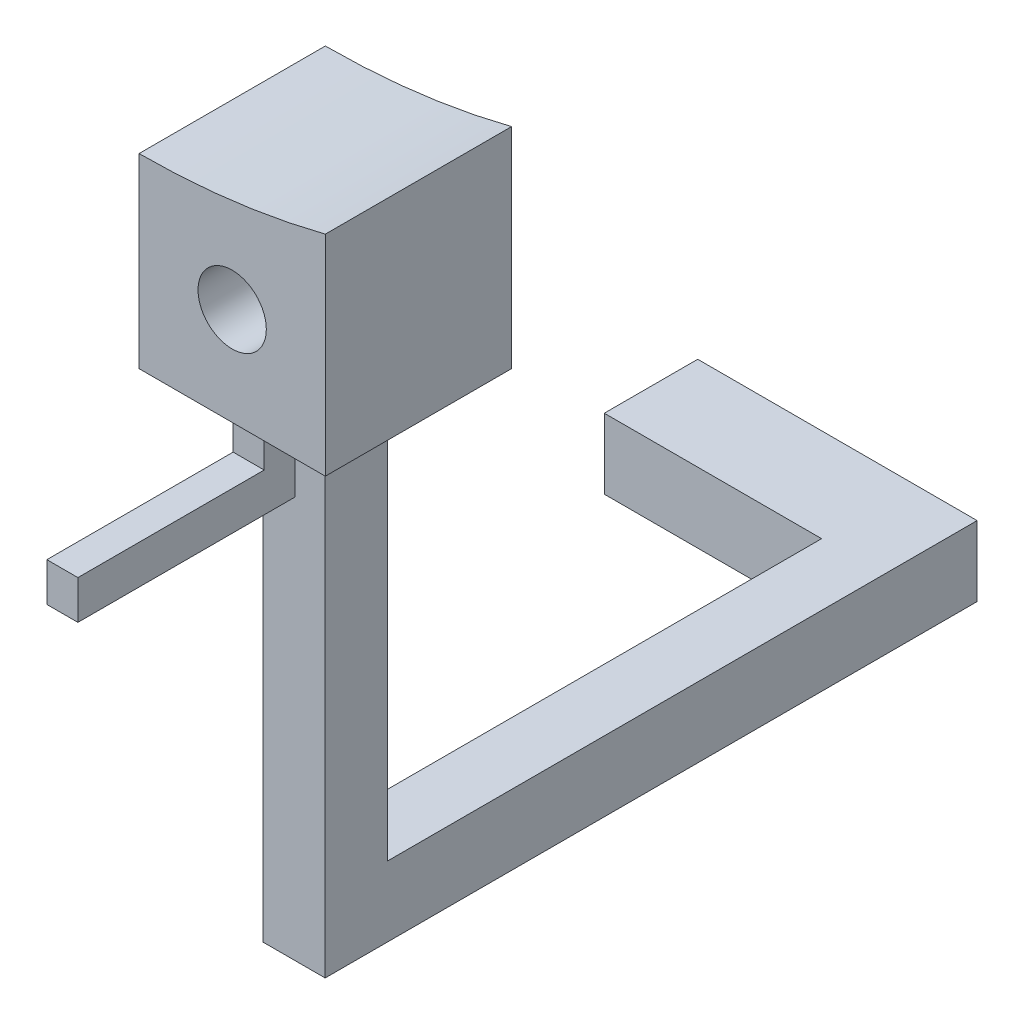
ISO-10303-21;
HEADER;
FILE_DESCRIPTION(('STEP AP214'),'2;1');
FILE_NAME('part.step','',(''),(''),'','','');
FILE_SCHEMA(('AUTOMOTIVE_DESIGN { 1 0 10303 214 1 1 1 1 }'));
ENDSEC;
DATA;
#1=APPLICATION_CONTEXT('core data for automotive mechanical design processes');
#2=APPLICATION_PROTOCOL_DEFINITION('international standard','automotive_design',2000,#1);
#3=PRODUCT_CONTEXT('',#1,'mechanical');
#4=PRODUCT('Part','Part','',(#3));
#5=PRODUCT_RELATED_PRODUCT_CATEGORY('part','',(#4));
#6=PRODUCT_DEFINITION_FORMATION('','',#4);
#7=PRODUCT_DEFINITION_CONTEXT('part definition',#1,'design');
#8=PRODUCT_DEFINITION('design','',#6,#7);
#9=PRODUCT_DEFINITION_SHAPE('','',#8);
#10=(LENGTH_UNIT() NAMED_UNIT(*) SI_UNIT(.MILLI.,.METRE.));
#11=(NAMED_UNIT(*) PLANE_ANGLE_UNIT() SI_UNIT($,.RADIAN.));
#12=(NAMED_UNIT(*) SI_UNIT($,.STERADIAN.) SOLID_ANGLE_UNIT());
#13=UNCERTAINTY_MEASURE_WITH_UNIT(LENGTH_MEASURE(1.E-05),#10,'distance_accuracy_value','');
#14=(GEOMETRIC_REPRESENTATION_CONTEXT(3) GLOBAL_UNCERTAINTY_ASSIGNED_CONTEXT((#13)) GLOBAL_UNIT_ASSIGNED_CONTEXT((#10,
#11,#12)) REPRESENTATION_CONTEXT('',''));
#15=CARTESIAN_POINT('',(0.,0.,0.));
#16=DIRECTION('',(0.,0.,1.));
#17=DIRECTION('',(1.,0.,0.));
#18=AXIS2_PLACEMENT_3D('',#15,#16,#17);
#19=CARTESIAN_POINT('',(3.,-27.1521035876475,6.));
#20=DIRECTION('',(0.,0.,-1.));
#21=DIRECTION('',(-1.,0.,0.));
#22=AXIS2_PLACEMENT_3D('',#19,#20,#21);
#23=CYLINDRICAL_SURFACE('',#22,1.1);
#24=CARTESIAN_POINT('',(3.,-27.1521035876475,6.));
#25=DIRECTION('',(0.,0.,1.));
#26=DIRECTION('',(1.,0.,0.));
#27=AXIS2_PLACEMENT_3D('',#24,#25,#26);
#28=CIRCLE('',#27,1.1);
#29=CARTESIAN_POINT('',(4.1,-27.1521035876475,6.));
#30=VERTEX_POINT('',#29);
#31=EDGE_CURVE('E271',#30,#30,#28,.T.);
#32=ORIENTED_EDGE('',*,*,#31,.T.);
#33=EDGE_LOOP('',(#32));
#34=FACE_BOUND('',#33,.T.);
#35=CARTESIAN_POINT('',(3.,-27.1521035876475,0.));
#36=DIRECTION('',(0.,0.,1.));
#37=DIRECTION('',(1.,0.,0.));
#38=AXIS2_PLACEMENT_3D('',#35,#36,#37);
#39=CIRCLE('',#38,1.1);
#40=CARTESIAN_POINT('',(4.1,-27.1521035876475,0.));
#41=VERTEX_POINT('',#40);
#42=EDGE_CURVE('E194',#41,#41,#39,.T.);
#43=ORIENTED_EDGE('',*,*,#42,.F.);
#44=EDGE_LOOP('',(#43));
#45=FACE_BOUND('',#44,.T.);
#46=ADVANCED_FACE('F38',(#34,#45),#23,.F.);
#47=CARTESIAN_POINT('',(1.99499278721881,-46.3,0.));
#48=DIRECTION('',(-1.,0.,0.));
#49=DIRECTION('',(0.,0.,1.));
#50=AXIS2_PLACEMENT_3D('',#47,#48,#49);
#51=PLANE('',#50);
#52=DIRECTION('',(0.,1.,0.));
#53=VECTOR('',#52,1.);
#54=CARTESIAN_POINT('',(1.99499278721881,-46.3,2.));
#55=LINE('',#54,#53);
#56=CARTESIAN_POINT('',(1.99499278721881,-44.0404224774381,2.));
#57=VERTEX_POINT('',#56);
#58=CARTESIAN_POINT('',(1.99499278721881,-30.3,2.));
#59=VERTEX_POINT('',#58);
#60=EDGE_CURVE('E253',#57,#59,#55,.T.);
#61=ORIENTED_EDGE('',*,*,#60,.F.);
#62=DIRECTION('',(0.,0.,1.));
#63=VECTOR('',#62,1.);
#64=CARTESIAN_POINT('',(1.99499278721881,-44.0404224774381,0.));
#65=LINE('',#64,#63);
#66=CARTESIAN_POINT('',(1.99499278721881,-44.0404224774381,-13.9905558463717));
#67=VERTEX_POINT('',#66);
#68=EDGE_CURVE('E179',#67,#57,#65,.T.);
#69=ORIENTED_EDGE('',*,*,#68,.F.);
#70=DIRECTION('',(0.,1.,0.));
#71=VECTOR('',#70,1.);
#72=CARTESIAN_POINT('',(1.99499278721881,-34.3058870924525,-13.9905558463717));
#73=LINE('',#72,#71);
#74=CARTESIAN_POINT('',(1.99499278721881,-46.3,-13.9905558463717));
#75=VERTEX_POINT('',#74);
#76=EDGE_CURVE('E178',#75,#67,#73,.T.);
#77=ORIENTED_EDGE('',*,*,#76,.F.);
#78=DIRECTION('',(0.,0.,1.));
#79=VECTOR('',#78,1.);
#80=CARTESIAN_POINT('',(1.99499278721881,-46.3,0.));
#81=LINE('',#80,#79);
#82=CARTESIAN_POINT('',(1.99499278721881,-46.3,4.));
#83=VERTEX_POINT('',#82);
#84=EDGE_CURVE('E251',#75,#83,#81,.T.);
#85=ORIENTED_EDGE('',*,*,#84,.T.);
#86=DIRECTION('',(0.,1.,0.));
#87=VECTOR('',#86,1.);
#88=CARTESIAN_POINT('',(1.99499278721881,-46.3,4.));
#89=LINE('',#88,#87);
#90=CARTESIAN_POINT('',(1.99499278721881,-30.3,4.));
#91=VERTEX_POINT('',#90);
#92=EDGE_CURVE('E263',#83,#91,#89,.T.);
#93=ORIENTED_EDGE('',*,*,#92,.T.);
#94=DIRECTION('',(0.,0.,1.));
#95=VECTOR('',#94,1.);
#96=CARTESIAN_POINT('',(1.99499278721881,-30.3,0.));
#97=LINE('',#96,#95);
#98=EDGE_CURVE('E248',#59,#91,#97,.T.);
#99=ORIENTED_EDGE('',*,*,#98,.F.);
#100=EDGE_LOOP('',(#61,#69,#77,#85,#93,#99));
#101=FACE_BOUND('',#100,.T.);
#102=ADVANCED_FACE('F330',(#101),#51,.T.);
#103=CARTESIAN_POINT('',(2.59354601361734,-32.8,5.56256108266805));
#104=DIRECTION('',(0.,0.,-1.));
#105=DIRECTION('',(-1.,0.,0.));
#106=AXIS2_PLACEMENT_3D('',#103,#104,#105);
#107=PLANE('',#106);
#108=DIRECTION('',(-1.,0.,0.));
#109=VECTOR('',#108,1.);
#110=CARTESIAN_POINT('',(3.59354601361734,-31.55,5.56256108266805));
#111=LINE('',#110,#109);
#112=CARTESIAN_POINT('',(3.59354601361734,-31.55,5.56256108266805));
#113=VERTEX_POINT('',#112);
#114=CARTESIAN_POINT('',(2.59354601361734,-31.55,5.56256108266805));
#115=VERTEX_POINT('',#114);
#116=EDGE_CURVE('E196',#113,#115,#111,.T.);
#117=ORIENTED_EDGE('',*,*,#116,.F.);
#118=DIRECTION('',(0.,1.,0.));
#119=VECTOR('',#118,1.);
#120=CARTESIAN_POINT('',(3.59354601361734,-32.8,5.56256108266805));
#121=LINE('',#120,#119);
#122=CARTESIAN_POINT('',(3.59354601361734,-30.3,5.56256108266805));
#123=VERTEX_POINT('',#122);
#124=EDGE_CURVE('E61',#113,#123,#121,.T.);
#125=ORIENTED_EDGE('',*,*,#124,.T.);
#126=DIRECTION('',(-1.,0.,0.));
#127=VECTOR('',#126,1.);
#128=CARTESIAN_POINT('',(2.59354601361734,-30.3,5.56256108266805));
#129=LINE('',#128,#127);
#130=CARTESIAN_POINT('',(2.59354601361734,-30.3,5.56256108266805));
#131=VERTEX_POINT('',#130);
#132=EDGE_CURVE('E224',#123,#131,#129,.T.);
#133=ORIENTED_EDGE('',*,*,#132,.T.);
#134=DIRECTION('',(0.,1.,0.));
#135=VECTOR('',#134,1.);
#136=CARTESIAN_POINT('',(2.59354601361734,-32.8,5.56256108266805));
#137=LINE('',#136,#135);
#138=EDGE_CURVE('E236',#115,#131,#137,.T.);
#139=ORIENTED_EDGE('',*,*,#138,.F.);
#140=EDGE_LOOP('',(#117,#125,#133,#139));
#141=FACE_BOUND('',#140,.T.);
#142=ADVANCED_FACE('F336',(#141),#107,.F.);
#143=CARTESIAN_POINT('',(0.,-30.3,6.));
#144=DIRECTION('',(0.,1.,0.));
#145=DIRECTION('',(0.,0.,1.));
#146=AXIS2_PLACEMENT_3D('',#143,#144,#145);
#147=PLANE('',#146);
#148=DIRECTION('',(1.,0.,0.));
#149=VECTOR('',#148,1.);
#150=CARTESIAN_POINT('',(0.,-30.3,2.));
#151=LINE('',#150,#149);
#152=CARTESIAN_POINT('',(3.99499278721881,-30.3,2.));
#153=VERTEX_POINT('',#152);
#154=EDGE_CURVE('E244',#59,#153,#151,.T.);
#155=ORIENTED_EDGE('',*,*,#154,.F.);
#156=ORIENTED_EDGE('',*,*,#98,.T.);
#157=DIRECTION('',(1.,0.,0.));
#158=VECTOR('',#157,1.);
#159=CARTESIAN_POINT('',(0.,-30.3,4.));
#160=LINE('',#159,#158);
#161=CARTESIAN_POINT('',(3.99499278721881,-30.3,4.));
#162=VERTEX_POINT('',#161);
#163=EDGE_CURVE('E259',#91,#162,#160,.T.);
#164=ORIENTED_EDGE('',*,*,#163,.T.);
#165=DIRECTION('',(0.,0.,1.));
#166=VECTOR('',#165,1.);
#167=CARTESIAN_POINT('',(3.99499278721881,-30.3,0.));
#168=LINE('',#167,#166);
#169=EDGE_CURVE('E256',#153,#162,#168,.T.);
#170=ORIENTED_EDGE('',*,*,#169,.F.);
#171=EDGE_LOOP('',(#155,#156,#164,#170));
#172=FACE_BOUND('',#171,.T.);
#173=DIRECTION('',(1.,0.,0.));
#174=VECTOR('',#173,1.);
#175=CARTESIAN_POINT('',(0.,-30.3,0.));
#176=LINE('',#175,#174);
#177=CARTESIAN_POINT('',(0.,-30.3,0.));
#178=VERTEX_POINT('',#177);
#179=CARTESIAN_POINT('',(6.,-30.3,0.));
#180=VERTEX_POINT('',#179);
#181=EDGE_CURVE('E290',#178,#180,#176,.T.);
#182=ORIENTED_EDGE('',*,*,#181,.T.);
#183=DIRECTION('',(0.,0.,-1.));
#184=VECTOR('',#183,1.);
#185=CARTESIAN_POINT('',(6.,-30.3,6.));
#186=LINE('',#185,#184);
#187=CARTESIAN_POINT('',(6.,-30.3,6.));
#188=VERTEX_POINT('',#187);
#189=EDGE_CURVE('E295',#188,#180,#186,.T.);
#190=ORIENTED_EDGE('',*,*,#189,.F.);
#191=DIRECTION('',(1.,0.,0.));
#192=VECTOR('',#191,1.);
#193=CARTESIAN_POINT('',(0.,-30.3,6.));
#194=LINE('',#193,#192);
#195=CARTESIAN_POINT('',(0.,-30.3,6.));
#196=VERTEX_POINT('',#195);
#197=EDGE_CURVE('E281',#196,#188,#194,.T.);
#198=ORIENTED_EDGE('',*,*,#197,.F.);
#199=DIRECTION('',(0.,0.,-1.));
#200=VECTOR('',#199,1.);
#201=CARTESIAN_POINT('',(0.,-30.3,6.));
#202=LINE('',#201,#200);
#203=EDGE_CURVE('E46',#196,#178,#202,.T.);
#204=ORIENTED_EDGE('',*,*,#203,.T.);
#205=EDGE_LOOP('',(#182,#190,#198,#204));
#206=FACE_BOUND('',#205,.T.);
#207=DIRECTION('',(0.,0.,1.));
#208=VECTOR('',#207,1.);
#209=CARTESIAN_POINT('',(3.59354601361734,-30.3,4.56256108266805));
#210=LINE('',#209,#208);
#211=CARTESIAN_POINT('',(3.59354601361734,-30.3,4.56256108266805));
#212=VERTEX_POINT('',#211);
#213=EDGE_CURVE('E213',#212,#123,#210,.T.);
#214=ORIENTED_EDGE('',*,*,#213,.F.);
#215=DIRECTION('',(1.,0.,0.));
#216=VECTOR('',#215,1.);
#217=CARTESIAN_POINT('',(2.59354601361734,-30.3,4.56256108266805));
#218=LINE('',#217,#216);
#219=CARTESIAN_POINT('',(2.59354601361734,-30.3,4.56256108266805));
#220=VERTEX_POINT('',#219);
#221=EDGE_CURVE('E217',#220,#212,#218,.T.);
#222=ORIENTED_EDGE('',*,*,#221,.F.);
#223=DIRECTION('',(0.,0.,-1.));
#224=VECTOR('',#223,1.);
#225=CARTESIAN_POINT('',(2.59354601361734,-30.3,4.56256108266805));
#226=LINE('',#225,#224);
#227=EDGE_CURVE('E226',#131,#220,#226,.T.);
#228=ORIENTED_EDGE('',*,*,#227,.F.);
#229=ORIENTED_EDGE('',*,*,#132,.F.);
#230=EDGE_LOOP('',(#214,#222,#228,#229));
#231=FACE_BOUND('',#230,.T.);
#232=ADVANCED_FACE('F302',(#172,#206,#231),#147,.F.);
#233=CARTESIAN_POINT('',(0.,-46.3,2.));
#234=DIRECTION('',(0.,0.,1.));
#235=DIRECTION('',(1.,0.,0.));
#236=AXIS2_PLACEMENT_3D('',#233,#234,#235);
#237=PLANE('',#236);
#238=DIRECTION('',(0.,1.,0.));
#239=VECTOR('',#238,1.);
#240=CARTESIAN_POINT('',(3.99499278721881,-46.3,2.));
#241=LINE('',#240,#239);
#242=CARTESIAN_POINT('',(3.99499278721881,-44.0404224774381,2.));
#243=VERTEX_POINT('',#242);
#244=EDGE_CURVE('E269',#243,#153,#241,.T.);
#245=ORIENTED_EDGE('',*,*,#244,.F.);
#246=DIRECTION('',(-1.,0.,0.));
#247=VECTOR('',#246,1.);
#248=CARTESIAN_POINT('',(4.99499278721881,-44.0404224774381,2.));
#249=LINE('',#248,#247);
#250=EDGE_CURVE('E180',#243,#57,#249,.T.);
#251=ORIENTED_EDGE('',*,*,#250,.T.);
#252=ORIENTED_EDGE('',*,*,#60,.T.);
#253=ORIENTED_EDGE('',*,*,#154,.T.);
#254=EDGE_LOOP('',(#245,#251,#252,#253));
#255=FACE_BOUND('',#254,.T.);
#256=ADVANCED_FACE('F342',(#255),#237,.F.);
#257=CARTESIAN_POINT('',(0.,0.,6.));
#258=DIRECTION('',(0.,0.,1.));
#259=DIRECTION('',(1.,0.,0.));
#260=AXIS2_PLACEMENT_3D('',#257,#258,#259);
#261=PLANE('',#260);
#262=CARTESIAN_POINT('',(0.,0.,6.));
#263=DIRECTION('',(0.,0.,-1.));
#264=DIRECTION('',(1.,0.,0.));
#265=AXIS2_PLACEMENT_3D('',#262,#263,#264);
#266=CIRCLE('',#265,24.3);
#267=CARTESIAN_POINT('',(6.,-23.5476113438285,6.));
#268=VERTEX_POINT('',#267);
#269=CARTESIAN_POINT('',(0.,-24.3,6.));
#270=VERTEX_POINT('',#269);
#271=EDGE_CURVE('E275',#268,#270,#266,.T.);
#272=ORIENTED_EDGE('',*,*,#271,.T.);
#273=DIRECTION('',(0.,-1.,0.));
#274=VECTOR('',#273,1.);
#275=CARTESIAN_POINT('',(0.,-24.3,6.));
#276=LINE('',#275,#274);
#277=EDGE_CURVE('E278',#270,#196,#276,.T.);
#278=ORIENTED_EDGE('',*,*,#277,.T.);
#279=ORIENTED_EDGE('',*,*,#197,.T.);
#280=DIRECTION('',(0.,1.,0.));
#281=VECTOR('',#280,1.);
#282=CARTESIAN_POINT('',(6.,-30.3,6.));
#283=LINE('',#282,#281);
#284=EDGE_CURVE('E283',#188,#268,#283,.T.);
#285=ORIENTED_EDGE('',*,*,#284,.T.);
#286=EDGE_LOOP('',(#272,#278,#279,#285));
#287=FACE_BOUND('',#286,.T.);
#288=ORIENTED_EDGE('',*,*,#31,.F.);
#289=EDGE_LOOP('',(#288));
#290=FACE_BOUND('',#289,.T.);
#291=ADVANCED_FACE('F318',(#287,#290),#261,.T.);
#292=CARTESIAN_POINT('',(0.,0.,0.));
#293=DIRECTION('',(0.,0.,1.));
#294=DIRECTION('',(1.,0.,0.));
#295=AXIS2_PLACEMENT_3D('',#292,#293,#294);
#296=PLANE('',#295);
#297=ORIENTED_EDGE('',*,*,#42,.T.);
#298=EDGE_LOOP('',(#297));
#299=FACE_BOUND('',#298,.T.);
#300=CARTESIAN_POINT('',(0.,0.,0.));
#301=DIRECTION('',(0.,0.,-1.));
#302=DIRECTION('',(1.,0.,0.));
#303=AXIS2_PLACEMENT_3D('',#300,#301,#302);
#304=CIRCLE('',#303,24.3);
#305=CARTESIAN_POINT('',(6.,-23.5476113438285,0.));
#306=VERTEX_POINT('',#305);
#307=CARTESIAN_POINT('',(0.,-24.3,0.));
#308=VERTEX_POINT('',#307);
#309=EDGE_CURVE('E274',#306,#308,#304,.T.);
#310=ORIENTED_EDGE('',*,*,#309,.F.);
#311=DIRECTION('',(0.,1.,0.));
#312=VECTOR('',#311,1.);
#313=CARTESIAN_POINT('',(6.,-30.3,0.));
#314=LINE('',#313,#312);
#315=EDGE_CURVE('E279',#180,#306,#314,.T.);
#316=ORIENTED_EDGE('',*,*,#315,.F.);
#317=ORIENTED_EDGE('',*,*,#181,.F.);
#318=DIRECTION('',(0.,-1.,0.));
#319=VECTOR('',#318,1.);
#320=CARTESIAN_POINT('',(0.,-24.3,0.));
#321=LINE('',#320,#319);
#322=EDGE_CURVE('E288',#308,#178,#321,.T.);
#323=ORIENTED_EDGE('',*,*,#322,.F.);
#324=EDGE_LOOP('',(#310,#316,#317,#323));
#325=FACE_BOUND('',#324,.T.);
#326=ADVANCED_FACE('F309',(#299,#325),#296,.F.);
#327=CARTESIAN_POINT('',(0.,0.,6.));
#328=DIRECTION('',(0.,0.,-1.));
#329=DIRECTION('',(-1.,0.,0.));
#330=AXIS2_PLACEMENT_3D('',#327,#328,#329);
#331=CYLINDRICAL_SURFACE('',#330,24.3);
#332=ORIENTED_EDGE('',*,*,#309,.T.);
#333=DIRECTION('',(0.,0.,-1.));
#334=VECTOR('',#333,1.);
#335=CARTESIAN_POINT('',(0.,-24.3,6.));
#336=LINE('',#335,#334);
#337=EDGE_CURVE('E11',#270,#308,#336,.T.);
#338=ORIENTED_EDGE('',*,*,#337,.F.);
#339=ORIENTED_EDGE('',*,*,#271,.F.);
#340=DIRECTION('',(0.,0.,-1.));
#341=VECTOR('',#340,1.);
#342=CARTESIAN_POINT('',(6.,-23.5476113438285,6.));
#343=LINE('',#342,#341);
#344=EDGE_CURVE('E285',#268,#306,#343,.T.);
#345=ORIENTED_EDGE('',*,*,#344,.T.);
#346=EDGE_LOOP('',(#332,#338,#339,#345));
#347=FACE_BOUND('',#346,.T.);
#348=ADVANCED_FACE('F40',(#347),#331,.F.);
#349=CARTESIAN_POINT('',(0.,-24.3,6.));
#350=DIRECTION('',(1.,0.,0.));
#351=DIRECTION('',(0.,1.,0.));
#352=AXIS2_PLACEMENT_3D('',#349,#350,#351);
#353=PLANE('',#352);
#354=ORIENTED_EDGE('',*,*,#322,.T.);
#355=ORIENTED_EDGE('',*,*,#203,.F.);
#356=ORIENTED_EDGE('',*,*,#277,.F.);
#357=ORIENTED_EDGE('',*,*,#337,.T.);
#358=EDGE_LOOP('',(#354,#355,#356,#357));
#359=FACE_BOUND('',#358,.T.);
#360=ADVANCED_FACE('F320',(#359),#353,.F.);
#361=CARTESIAN_POINT('',(6.,-30.3,6.));
#362=DIRECTION('',(-1.,0.,0.));
#363=DIRECTION('',(0.,0.,1.));
#364=AXIS2_PLACEMENT_3D('',#361,#362,#363);
#365=PLANE('',#364);
#366=ORIENTED_EDGE('',*,*,#315,.T.);
#367=ORIENTED_EDGE('',*,*,#344,.F.);
#368=ORIENTED_EDGE('',*,*,#284,.F.);
#369=ORIENTED_EDGE('',*,*,#189,.T.);
#370=EDGE_LOOP('',(#366,#367,#368,#369));
#371=FACE_BOUND('',#370,.T.);
#372=ADVANCED_FACE('F312',(#371),#365,.F.);
#373=CARTESIAN_POINT('',(3.99499278721881,-46.3,0.));
#374=DIRECTION('',(-1.,0.,0.));
#375=DIRECTION('',(0.,0.,1.));
#376=AXIS2_PLACEMENT_3D('',#373,#374,#375);
#377=PLANE('',#376);
#378=DIRECTION('',(0.,0.,1.));
#379=VECTOR('',#378,1.);
#380=CARTESIAN_POINT('',(3.99499278721881,-44.0404224774381,0.));
#381=LINE('',#380,#379);
#382=CARTESIAN_POINT('',(3.99499278721881,-44.0404224774381,-17.));
#383=VERTEX_POINT('',#382);
#384=EDGE_CURVE('E370',#383,#243,#381,.T.);
#385=ORIENTED_EDGE('',*,*,#384,.T.);
#386=ORIENTED_EDGE('',*,*,#244,.T.);
#387=ORIENTED_EDGE('',*,*,#169,.T.);
#388=DIRECTION('',(0.,1.,0.));
#389=VECTOR('',#388,1.);
#390=CARTESIAN_POINT('',(3.99499278721881,-46.3,4.));
#391=LINE('',#390,#389);
#392=CARTESIAN_POINT('',(3.99499278721881,-46.3,4.));
#393=VERTEX_POINT('',#392);
#394=EDGE_CURVE('E266',#393,#162,#391,.T.);
#395=ORIENTED_EDGE('',*,*,#394,.F.);
#396=DIRECTION('',(0.,0.,1.));
#397=VECTOR('',#396,1.);
#398=CARTESIAN_POINT('',(3.99499278721881,-46.3,0.));
#399=LINE('',#398,#397);
#400=CARTESIAN_POINT('',(3.99499278721881,-46.3,-17.));
#401=VERTEX_POINT('',#400);
#402=EDGE_CURVE('E245',#401,#393,#399,.T.);
#403=ORIENTED_EDGE('',*,*,#402,.F.);
#404=DIRECTION('',(0.,-1.,0.));
#405=VECTOR('',#404,1.);
#406=CARTESIAN_POINT('',(3.99499278721881,-34.3058870924525,-17.));
#407=LINE('',#406,#405);
#408=EDGE_CURVE('E239',#383,#401,#407,.T.);
#409=ORIENTED_EDGE('',*,*,#408,.F.);
#410=EDGE_LOOP('',(#385,#386,#387,#395,#403,#409));
#411=FACE_BOUND('',#410,.T.);
#412=ADVANCED_FACE('F326',(#411),#377,.F.);
#413=CARTESIAN_POINT('',(0.,-46.3,4.));
#414=DIRECTION('',(0.,0.,1.));
#415=DIRECTION('',(1.,0.,0.));
#416=AXIS2_PLACEMENT_3D('',#413,#414,#415);
#417=PLANE('',#416);
#418=ORIENTED_EDGE('',*,*,#163,.F.);
#419=ORIENTED_EDGE('',*,*,#92,.F.);
#420=DIRECTION('',(1.,0.,0.));
#421=VECTOR('',#420,1.);
#422=CARTESIAN_POINT('',(0.,-46.3,4.));
#423=LINE('',#422,#421);
#424=EDGE_CURVE('E247',#83,#393,#423,.T.);
#425=ORIENTED_EDGE('',*,*,#424,.T.);
#426=ORIENTED_EDGE('',*,*,#394,.T.);
#427=EDGE_LOOP('',(#418,#419,#425,#426));
#428=FACE_BOUND('',#427,.T.);
#429=ADVANCED_FACE('F364',(#428),#417,.T.);
#430=CARTESIAN_POINT('',(0.,-46.3,0.));
#431=DIRECTION('',(0.,-1.,0.));
#432=DIRECTION('',(0.,0.,-1.));
#433=AXIS2_PLACEMENT_3D('',#430,#431,#432);
#434=PLANE('',#433);
#435=ORIENTED_EDGE('',*,*,#84,.F.);
#436=DIRECTION('',(1.,0.,0.));
#437=VECTOR('',#436,1.);
#438=CARTESIAN_POINT('',(-5.00500721278119,-46.3,-13.9905558463717));
#439=LINE('',#438,#437);
#440=CARTESIAN_POINT('',(-5.00500721278119,-46.3,-13.9905558463717));
#441=VERTEX_POINT('',#440);
#442=EDGE_CURVE('E188',#441,#75,#439,.T.);
#443=ORIENTED_EDGE('',*,*,#442,.F.);
#444=DIRECTION('',(0.,0.,1.));
#445=VECTOR('',#444,1.);
#446=CARTESIAN_POINT('',(-5.00500721278119,-46.3,-13.9905558463717));
#447=LINE('',#446,#445);
#448=CARTESIAN_POINT('',(-5.00500721278119,-46.3,-17.));
#449=VERTEX_POINT('',#448);
#450=EDGE_CURVE('E184',#449,#441,#447,.T.);
#451=ORIENTED_EDGE('',*,*,#450,.F.);
#452=DIRECTION('',(-1.,0.,0.));
#453=VECTOR('',#452,1.);
#454=CARTESIAN_POINT('',(3.99499278721881,-46.3,-17.));
#455=LINE('',#454,#453);
#456=EDGE_CURVE('E241',#401,#449,#455,.T.);
#457=ORIENTED_EDGE('',*,*,#456,.F.);
#458=ORIENTED_EDGE('',*,*,#402,.T.);
#459=ORIENTED_EDGE('',*,*,#424,.F.);
#460=EDGE_LOOP('',(#435,#443,#451,#457,#458,#459));
#461=FACE_BOUND('',#460,.T.);
#462=ADVANCED_FACE('F380',(#461),#434,.T.);
#463=CARTESIAN_POINT('',(0.,0.,-17.));
#464=DIRECTION('',(0.,0.,-1.));
#465=DIRECTION('',(-1.,0.,0.));
#466=AXIS2_PLACEMENT_3D('',#463,#464,#465);
#467=PLANE('',#466);
#468=DIRECTION('',(-1.,0.,0.));
#469=VECTOR('',#468,1.);
#470=CARTESIAN_POINT('',(4.99499278721881,-44.0404224774381,-17.));
#471=LINE('',#470,#469);
#472=CARTESIAN_POINT('',(-5.00500721278119,-44.0404224774381,-17.));
#473=VERTEX_POINT('',#472);
#474=EDGE_CURVE('E53',#383,#473,#471,.T.);
#475=ORIENTED_EDGE('',*,*,#474,.F.);
#476=ORIENTED_EDGE('',*,*,#408,.T.);
#477=ORIENTED_EDGE('',*,*,#456,.T.);
#478=DIRECTION('',(0.,-1.,0.));
#479=VECTOR('',#478,1.);
#480=CARTESIAN_POINT('',(-5.00500721278119,-46.3,-17.));
#481=LINE('',#480,#479);
#482=EDGE_CURVE('E186',#473,#449,#481,.T.);
#483=ORIENTED_EDGE('',*,*,#482,.F.);
#484=EDGE_LOOP('',(#475,#476,#477,#483));
#485=FACE_BOUND('',#484,.T.);
#486=ADVANCED_FACE('F383',(#485),#467,.T.);
#487=CARTESIAN_POINT('',(3.59354601361734,-32.8,4.56256108266805));
#488=DIRECTION('',(-1.,0.,0.));
#489=DIRECTION('',(0.,0.,1.));
#490=AXIS2_PLACEMENT_3D('',#487,#488,#489);
#491=PLANE('',#490);
#492=ORIENTED_EDGE('',*,*,#213,.T.);
#493=ORIENTED_EDGE('',*,*,#124,.F.);
#494=DIRECTION('',(0.,0.,-1.));
#495=VECTOR('',#494,1.);
#496=CARTESIAN_POINT('',(3.59354601361734,-31.55,11.5625610826681));
#497=LINE('',#496,#495);
#498=CARTESIAN_POINT('',(3.59354601361734,-31.55,11.5625610826681));
#499=VERTEX_POINT('',#498);
#500=EDGE_CURVE('E211',#499,#113,#497,.T.);
#501=ORIENTED_EDGE('',*,*,#500,.F.);
#502=DIRECTION('',(0.,1.,0.));
#503=VECTOR('',#502,1.);
#504=CARTESIAN_POINT('',(3.59354601361734,-32.8,11.5625610826681));
#505=LINE('',#504,#503);
#506=CARTESIAN_POINT('',(3.59354601361734,-32.8,11.5625610826681));
#507=VERTEX_POINT('',#506);
#508=EDGE_CURVE('E203',#507,#499,#505,.T.);
#509=ORIENTED_EDGE('',*,*,#508,.F.);
#510=DIRECTION('',(0.,0.,1.));
#511=VECTOR('',#510,1.);
#512=CARTESIAN_POINT('',(3.59354601361734,-32.8,4.56256108266805));
#513=LINE('',#512,#511);
#514=CARTESIAN_POINT('',(3.59354601361734,-32.8,4.56256108266805));
#515=VERTEX_POINT('',#514);
#516=EDGE_CURVE('E214',#515,#507,#513,.T.);
#517=ORIENTED_EDGE('',*,*,#516,.F.);
#518=DIRECTION('',(0.,1.,0.));
#519=VECTOR('',#518,1.);
#520=CARTESIAN_POINT('',(3.59354601361734,-32.8,4.56256108266805));
#521=LINE('',#520,#519);
#522=EDGE_CURVE('E221',#515,#212,#521,.T.);
#523=ORIENTED_EDGE('',*,*,#522,.T.);
#524=EDGE_LOOP('',(#492,#493,#501,#509,#517,#523));
#525=FACE_BOUND('',#524,.T.);
#526=ADVANCED_FACE('F385',(#525),#491,.F.);
#527=CARTESIAN_POINT('',(2.59354601361734,-32.8,4.56256108266805));
#528=DIRECTION('',(1.,0.,0.));
#529=DIRECTION('',(0.,0.,-1.));
#530=AXIS2_PLACEMENT_3D('',#527,#528,#529);
#531=PLANE('',#530);
#532=ORIENTED_EDGE('',*,*,#227,.T.);
#533=DIRECTION('',(0.,1.,0.));
#534=VECTOR('',#533,1.);
#535=CARTESIAN_POINT('',(2.59354601361734,-32.8,4.56256108266805));
#536=LINE('',#535,#534);
#537=CARTESIAN_POINT('',(2.59354601361734,-32.8,4.56256108266805));
#538=VERTEX_POINT('',#537);
#539=EDGE_CURVE('E233',#538,#220,#536,.T.);
#540=ORIENTED_EDGE('',*,*,#539,.F.);
#541=DIRECTION('',(0.,0.,-1.));
#542=VECTOR('',#541,1.);
#543=CARTESIAN_POINT('',(2.59354601361734,-32.8,4.56256108266805));
#544=LINE('',#543,#542);
#545=CARTESIAN_POINT('',(2.59354601361734,-32.8,11.5625610826681));
#546=VERTEX_POINT('',#545);
#547=EDGE_CURVE('E216',#546,#538,#544,.T.);
#548=ORIENTED_EDGE('',*,*,#547,.F.);
#549=DIRECTION('',(0.,-1.,0.));
#550=VECTOR('',#549,1.);
#551=CARTESIAN_POINT('',(2.59354601361734,-31.55,11.5625610826681));
#552=LINE('',#551,#550);
#553=CARTESIAN_POINT('',(2.59354601361734,-31.55,11.5625610826681));
#554=VERTEX_POINT('',#553);
#555=EDGE_CURVE('E197',#554,#546,#552,.T.);
#556=ORIENTED_EDGE('',*,*,#555,.F.);
#557=DIRECTION('',(0.,0.,-1.));
#558=VECTOR('',#557,1.);
#559=CARTESIAN_POINT('',(2.59354601361734,-31.55,11.5625610826681));
#560=LINE('',#559,#558);
#561=EDGE_CURVE('E207',#554,#115,#560,.T.);
#562=ORIENTED_EDGE('',*,*,#561,.T.);
#563=ORIENTED_EDGE('',*,*,#138,.T.);
#564=EDGE_LOOP('',(#532,#540,#548,#556,#562,#563));
#565=FACE_BOUND('',#564,.T.);
#566=ADVANCED_FACE('F391',(#565),#531,.F.);
#567=CARTESIAN_POINT('',(2.59354601361734,-32.8,4.56256108266805));
#568=DIRECTION('',(0.,0.,1.));
#569=DIRECTION('',(1.,0.,0.));
#570=AXIS2_PLACEMENT_3D('',#567,#568,#569);
#571=PLANE('',#570);
#572=ORIENTED_EDGE('',*,*,#221,.T.);
#573=ORIENTED_EDGE('',*,*,#522,.F.);
#574=DIRECTION('',(1.,0.,0.));
#575=VECTOR('',#574,1.);
#576=CARTESIAN_POINT('',(2.59354601361734,-32.8,4.56256108266805));
#577=LINE('',#576,#575);
#578=EDGE_CURVE('E219',#538,#515,#577,.T.);
#579=ORIENTED_EDGE('',*,*,#578,.F.);
#580=ORIENTED_EDGE('',*,*,#539,.T.);
#581=EDGE_LOOP('',(#572,#573,#579,#580));
#582=FACE_BOUND('',#581,.T.);
#583=ADVANCED_FACE('F508',(#582),#571,.F.);
#584=CARTESIAN_POINT('',(0.,-32.8,0.));
#585=DIRECTION('',(0.,1.,0.));
#586=DIRECTION('',(0.,0.,1.));
#587=AXIS2_PLACEMENT_3D('',#584,#585,#586);
#588=PLANE('',#587);
#589=ORIENTED_EDGE('',*,*,#516,.T.);
#590=DIRECTION('',(1.,0.,0.));
#591=VECTOR('',#590,1.);
#592=CARTESIAN_POINT('',(2.59354601361734,-32.8,11.5625610826681));
#593=LINE('',#592,#591);
#594=EDGE_CURVE('E200',#546,#507,#593,.T.);
#595=ORIENTED_EDGE('',*,*,#594,.F.);
#596=ORIENTED_EDGE('',*,*,#547,.T.);
#597=ORIENTED_EDGE('',*,*,#578,.T.);
#598=EDGE_LOOP('',(#589,#595,#596,#597));
#599=FACE_BOUND('',#598,.T.);
#600=ADVANCED_FACE('F519',(#599),#588,.F.);
#601=CARTESIAN_POINT('',(3.59354601361734,-31.55,11.5625610826681));
#602=DIRECTION('',(0.,-1.,0.));
#603=DIRECTION('',(0.,0.,-1.));
#604=AXIS2_PLACEMENT_3D('',#601,#602,#603);
#605=PLANE('',#604);
#606=ORIENTED_EDGE('',*,*,#116,.T.);
#607=ORIENTED_EDGE('',*,*,#561,.F.);
#608=DIRECTION('',(-1.,0.,0.));
#609=VECTOR('',#608,1.);
#610=CARTESIAN_POINT('',(3.59354601361734,-31.55,11.5625610826681));
#611=LINE('',#610,#609);
#612=EDGE_CURVE('E205',#499,#554,#611,.T.);
#613=ORIENTED_EDGE('',*,*,#612,.F.);
#614=ORIENTED_EDGE('',*,*,#500,.T.);
#615=EDGE_LOOP('',(#606,#607,#613,#614));
#616=FACE_BOUND('',#615,.T.);
#617=ADVANCED_FACE('F527',(#616),#605,.F.);
#618=CARTESIAN_POINT('',(0.,0.,11.5625610826681));
#619=DIRECTION('',(0.,0.,1.));
#620=DIRECTION('',(1.,0.,0.));
#621=AXIS2_PLACEMENT_3D('',#618,#619,#620);
#622=PLANE('',#621);
#623=ORIENTED_EDGE('',*,*,#555,.T.);
#624=ORIENTED_EDGE('',*,*,#594,.T.);
#625=ORIENTED_EDGE('',*,*,#508,.T.);
#626=ORIENTED_EDGE('',*,*,#612,.T.);
#627=EDGE_LOOP('',(#623,#624,#625,#626));
#628=FACE_BOUND('',#627,.T.);
#629=ADVANCED_FACE('F419',(#628),#622,.T.);
#630=CARTESIAN_POINT('',(-5.00500721278119,-34.3058870924525,-13.9905558463717));
#631=DIRECTION('',(0.,0.,-1.));
#632=DIRECTION('',(0.,1.,0.));
#633=AXIS2_PLACEMENT_3D('',#630,#631,#632);
#634=PLANE('',#633);
#635=ORIENTED_EDGE('',*,*,#76,.T.);
#636=DIRECTION('',(-1.,0.,0.));
#637=VECTOR('',#636,1.);
#638=CARTESIAN_POINT('',(-5.00500721278119,-44.0404224774381,-13.9905558463717));
#639=LINE('',#638,#637);
#640=CARTESIAN_POINT('',(-5.00500721278119,-44.0404224774381,-13.9905558463717));
#641=VERTEX_POINT('',#640);
#642=EDGE_CURVE('E166',#67,#641,#639,.T.);
#643=ORIENTED_EDGE('',*,*,#642,.T.);
#644=DIRECTION('',(0.,1.,0.));
#645=VECTOR('',#644,1.);
#646=CARTESIAN_POINT('',(-5.00500721278119,-34.3058870924525,-13.9905558463717));
#647=LINE('',#646,#645);
#648=EDGE_CURVE('E175',#441,#641,#647,.T.);
#649=ORIENTED_EDGE('',*,*,#648,.F.);
#650=ORIENTED_EDGE('',*,*,#442,.T.);
#651=EDGE_LOOP('',(#635,#643,#649,#650));
#652=FACE_BOUND('',#651,.T.);
#653=ADVANCED_FACE('F174',(#652),#634,.F.);
#654=CARTESIAN_POINT('',(-5.00500721278119,0.,0.));
#655=DIRECTION('',(1.,0.,0.));
#656=DIRECTION('',(0.,0.,-1.));
#657=AXIS2_PLACEMENT_3D('',#654,#655,#656);
#658=PLANE('',#657);
#659=ORIENTED_EDGE('',*,*,#648,.T.);
#660=DIRECTION('',(0.,0.,1.));
#661=VECTOR('',#660,1.);
#662=CARTESIAN_POINT('',(-5.00500721278119,-44.0404224774381,2.));
#663=LINE('',#662,#661);
#664=EDGE_CURVE('E162',#473,#641,#663,.T.);
#665=ORIENTED_EDGE('',*,*,#664,.F.);
#666=ORIENTED_EDGE('',*,*,#482,.T.);
#667=ORIENTED_EDGE('',*,*,#450,.T.);
#668=EDGE_LOOP('',(#659,#665,#666,#667));
#669=FACE_BOUND('',#668,.T.);
#670=ADVANCED_FACE('F182',(#669),#658,.F.);
#671=CARTESIAN_POINT('',(4.99499278721881,-44.0404224774381,2.));
#672=DIRECTION('',(0.,-1.,0.));
#673=DIRECTION('',(0.,0.,-1.));
#674=AXIS2_PLACEMENT_3D('',#671,#672,#673);
#675=PLANE('',#674);
#676=ORIENTED_EDGE('',*,*,#474,.T.);
#677=ORIENTED_EDGE('',*,*,#664,.T.);
#678=ORIENTED_EDGE('',*,*,#642,.F.);
#679=ORIENTED_EDGE('',*,*,#68,.T.);
#680=ORIENTED_EDGE('',*,*,#250,.F.);
#681=ORIENTED_EDGE('',*,*,#384,.F.);
#682=EDGE_LOOP('',(#676,#677,#678,#679,#680,#681));
#683=FACE_BOUND('',#682,.T.);
#684=ADVANCED_FACE('F164',(#683),#675,.F.);
#685=CLOSED_SHELL('',(#46,#102,#142,#232,#256,#291,#326,#348,#360,#372,#412,#429,#462,#486,#526,
#566,#583,#600,#617,#629,#653,#670,#684));
#686=MANIFOLD_SOLID_BREP('B2',#685);
#687=ADVANCED_BREP_SHAPE_REPRESENTATION('',(#18,#686),#14);
#688=SHAPE_DEFINITION_REPRESENTATION(#9,#687);
ENDSEC;
END-ISO-10303-21;
